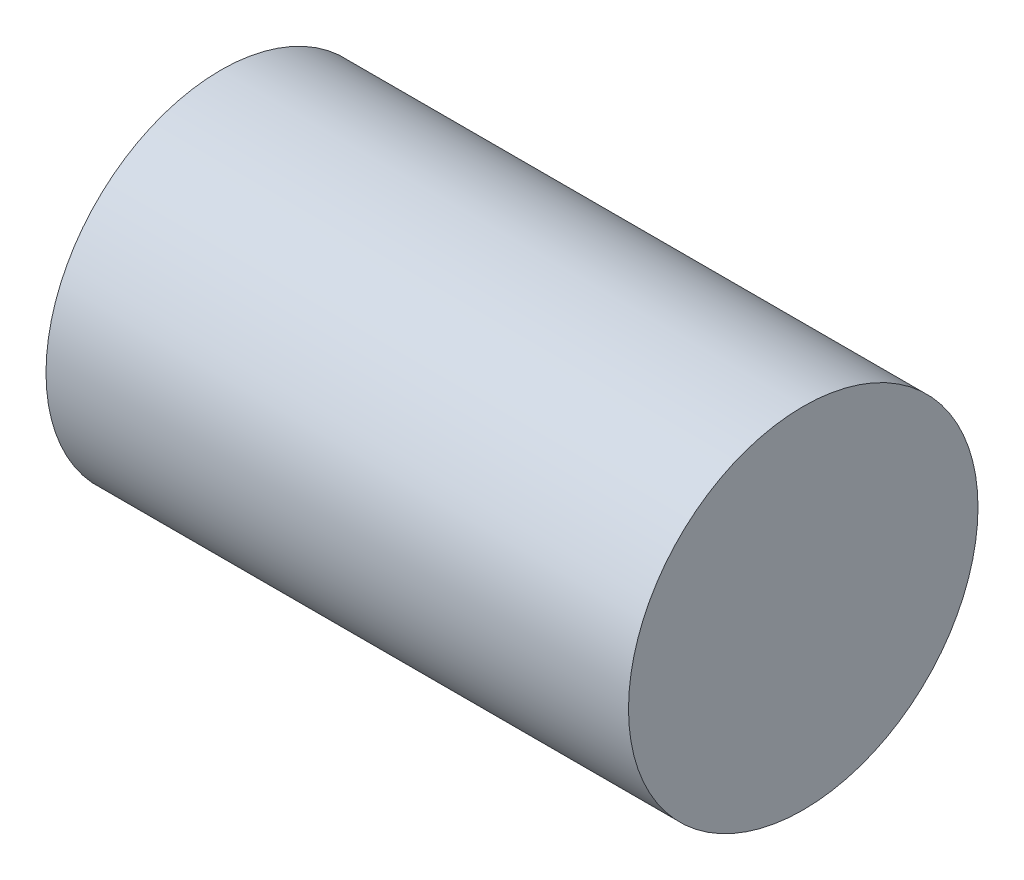
ISO-10303-21;
HEADER;
FILE_DESCRIPTION(('STEP AP214'),'2;1');
FILE_NAME('part.step','',(''),(''),'','','');
FILE_SCHEMA(('AUTOMOTIVE_DESIGN { 1 0 10303 214 1 1 1 1 }'));
ENDSEC;
DATA;
#1=APPLICATION_CONTEXT('core data for automotive mechanical design processes');
#2=APPLICATION_PROTOCOL_DEFINITION('international standard','automotive_design',2000,#1);
#3=PRODUCT_CONTEXT('',#1,'mechanical');
#4=PRODUCT('Part','Part','',(#3));
#5=PRODUCT_RELATED_PRODUCT_CATEGORY('part','',(#4));
#6=PRODUCT_DEFINITION_FORMATION('','',#4);
#7=PRODUCT_DEFINITION_CONTEXT('part definition',#1,'design');
#8=PRODUCT_DEFINITION('design','',#6,#7);
#9=PRODUCT_DEFINITION_SHAPE('','',#8);
#10=(LENGTH_UNIT() NAMED_UNIT(*) SI_UNIT(.MILLI.,.METRE.));
#11=(NAMED_UNIT(*) PLANE_ANGLE_UNIT() SI_UNIT($,.RADIAN.));
#12=(NAMED_UNIT(*) SI_UNIT($,.STERADIAN.) SOLID_ANGLE_UNIT());
#13=UNCERTAINTY_MEASURE_WITH_UNIT(LENGTH_MEASURE(1.E-05),#10,'distance_accuracy_value','');
#14=(GEOMETRIC_REPRESENTATION_CONTEXT(3) GLOBAL_UNCERTAINTY_ASSIGNED_CONTEXT((#13)) GLOBAL_UNIT_ASSIGNED_CONTEXT((#10,
#11,#12)) REPRESENTATION_CONTEXT('',''));
#15=CARTESIAN_POINT('',(0.,0.,0.));
#16=DIRECTION('',(0.,0.,1.));
#17=DIRECTION('',(1.,0.,0.));
#18=AXIS2_PLACEMENT_3D('',#15,#16,#17);
#19=CARTESIAN_POINT('',(5.,0.,0.));
#20=DIRECTION('',(-1.,0.,0.));
#21=DIRECTION('',(0.,0.,1.));
#22=AXIS2_PLACEMENT_3D('',#19,#20,#21);
#23=CYLINDRICAL_SURFACE('',#22,1.5);
#24=CARTESIAN_POINT('',(5.,0.,0.));
#25=DIRECTION('',(1.,0.,0.));
#26=DIRECTION('',(0.,0.,-1.));
#27=AXIS2_PLACEMENT_3D('',#24,#25,#26);
#28=CIRCLE('',#27,1.5);
#29=CARTESIAN_POINT('',(5.,0.,-1.5));
#30=VERTEX_POINT('',#29);
#31=EDGE_CURVE('E10',#30,#30,#28,.T.);
#32=ORIENTED_EDGE('',*,*,#31,.F.);
#33=EDGE_LOOP('',(#32));
#34=FACE_BOUND('',#33,.T.);
#35=CARTESIAN_POINT('',(0.,0.,0.));
#36=DIRECTION('',(1.,0.,0.));
#37=DIRECTION('',(0.,0.,-1.));
#38=AXIS2_PLACEMENT_3D('',#35,#36,#37);
#39=CIRCLE('',#38,1.5);
#40=CARTESIAN_POINT('',(0.,0.,-1.5));
#41=VERTEX_POINT('',#40);
#42=EDGE_CURVE('E40',#41,#41,#39,.T.);
#43=ORIENTED_EDGE('',*,*,#42,.T.);
#44=EDGE_LOOP('',(#43));
#45=FACE_BOUND('',#44,.T.);
#46=ADVANCED_FACE('F37',(#34,#45),#23,.T.);
#47=CARTESIAN_POINT('',(5.,0.,0.));
#48=DIRECTION('',(1.,0.,0.));
#49=DIRECTION('',(0.,0.,-1.));
#50=AXIS2_PLACEMENT_3D('',#47,#48,#49);
#51=PLANE('',#50);
#52=ORIENTED_EDGE('',*,*,#31,.T.);
#53=EDGE_LOOP('',(#52));
#54=FACE_BOUND('',#53,.T.);
#55=ADVANCED_FACE('F54',(#54),#51,.T.);
#56=CARTESIAN_POINT('',(0.,0.,0.));
#57=DIRECTION('',(1.,0.,0.));
#58=DIRECTION('',(0.,0.,-1.));
#59=AXIS2_PLACEMENT_3D('',#56,#57,#58);
#60=PLANE('',#59);
#61=ORIENTED_EDGE('',*,*,#42,.F.);
#62=EDGE_LOOP('',(#61));
#63=FACE_BOUND('',#62,.T.);
#64=ADVANCED_FACE('F52',(#63),#60,.F.);
#65=CLOSED_SHELL('',(#46,#55,#64));
#66=MANIFOLD_SOLID_BREP('B2',#65);
#67=ADVANCED_BREP_SHAPE_REPRESENTATION('',(#18,#66),#14);
#68=SHAPE_DEFINITION_REPRESENTATION(#9,#67);
ENDSEC;
END-ISO-10303-21;
